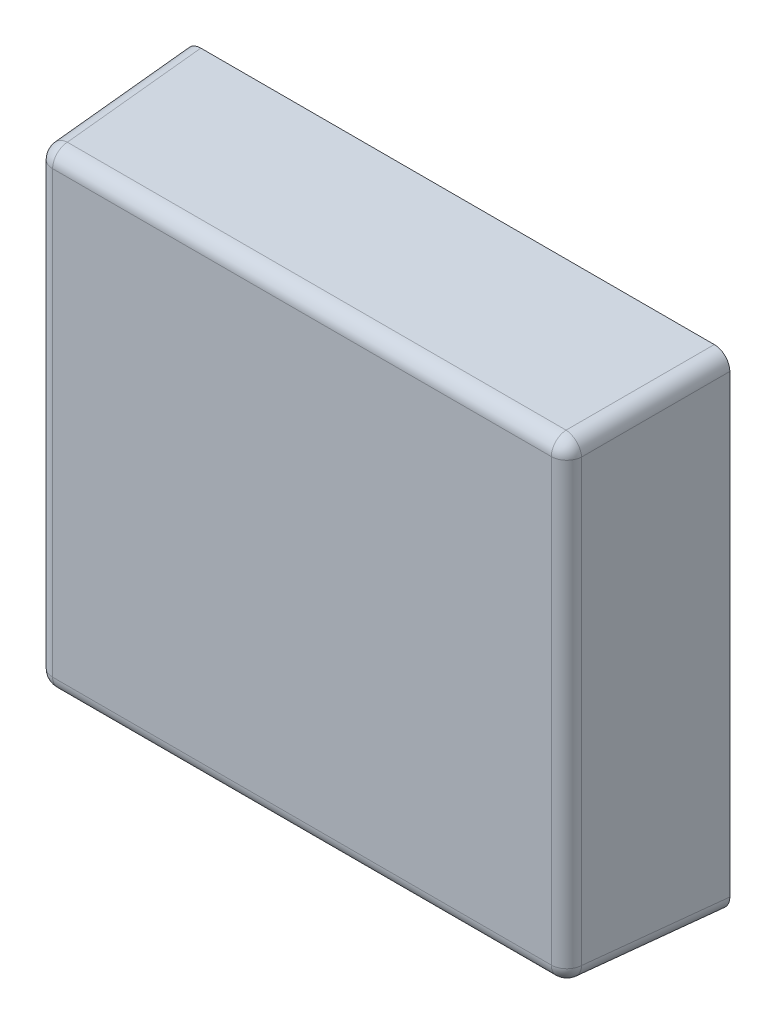
ISO-10303-21;
HEADER;
FILE_DESCRIPTION(('STEP AP214'),'2;1');
FILE_NAME('part.step','',(''),(''),'','','');
FILE_SCHEMA(('AUTOMOTIVE_DESIGN { 1 0 10303 214 1 1 1 1 }'));
ENDSEC;
DATA;
#1=APPLICATION_CONTEXT('core data for automotive mechanical design processes');
#2=APPLICATION_PROTOCOL_DEFINITION('international standard','automotive_design',2000,#1);
#3=PRODUCT_CONTEXT('',#1,'mechanical');
#4=PRODUCT('Part','Part','',(#3));
#5=PRODUCT_RELATED_PRODUCT_CATEGORY('part','',(#4));
#6=PRODUCT_DEFINITION_FORMATION('','',#4);
#7=PRODUCT_DEFINITION_CONTEXT('part definition',#1,'design');
#8=PRODUCT_DEFINITION('design','',#6,#7);
#9=PRODUCT_DEFINITION_SHAPE('','',#8);
#10=(LENGTH_UNIT() NAMED_UNIT(*) SI_UNIT(.MILLI.,.METRE.));
#11=(NAMED_UNIT(*) PLANE_ANGLE_UNIT() SI_UNIT($,.RADIAN.));
#12=(NAMED_UNIT(*) SI_UNIT($,.STERADIAN.) SOLID_ANGLE_UNIT());
#13=UNCERTAINTY_MEASURE_WITH_UNIT(LENGTH_MEASURE(1.E-05),#10,'distance_accuracy_value','');
#14=(GEOMETRIC_REPRESENTATION_CONTEXT(3) GLOBAL_UNCERTAINTY_ASSIGNED_CONTEXT((#13)) GLOBAL_UNIT_ASSIGNED_CONTEXT((#10,
#11,#12)) REPRESENTATION_CONTEXT('',''));
#15=CARTESIAN_POINT('',(0.,0.,0.));
#16=DIRECTION('',(0.,0.,1.));
#17=DIRECTION('',(1.,0.,0.));
#18=AXIS2_PLACEMENT_3D('',#15,#16,#17);
#19=CARTESIAN_POINT('',(-0.7,-0.625,0.4));
#20=DIRECTION('',(0.,0.,1.));
#21=DIRECTION('',(1.,0.,0.));
#22=AXIS2_PLACEMENT_3D('',#19,#20,#21);
#23=PLANE('',#22);
#24=DIRECTION('',(0.,1.,0.));
#25=VECTOR('',#24,1.);
#26=CARTESIAN_POINT('',(-0.641078305618185,-0.625,0.4));
#27=LINE('',#26,#25);
#28=CARTESIAN_POINT('',(-0.641078305618185,-0.566078305618188,0.4));
#29=VERTEX_POINT('',#28);
#30=CARTESIAN_POINT('',(-0.641078305618185,0.566078305618189,0.4));
#31=VERTEX_POINT('',#30);
#32=EDGE_CURVE('E98',#29,#31,#27,.T.);
#33=ORIENTED_EDGE('',*,*,#32,.F.);
#34=DIRECTION('',(-1.,0.,0.));
#35=VECTOR('',#34,1.);
#36=CARTESIAN_POINT('',(-0.7,-0.566078305618188,0.4));
#37=LINE('',#36,#35);
#38=CARTESIAN_POINT('',(0.641078305618192,-0.566078305618188,0.4));
#39=VERTEX_POINT('',#38);
#40=EDGE_CURVE('E100',#39,#29,#37,.T.);
#41=ORIENTED_EDGE('',*,*,#40,.F.);
#42=DIRECTION('',(0.,-1.,0.));
#43=VECTOR('',#42,1.);
#44=CARTESIAN_POINT('',(0.641078305618192,-0.625,0.4));
#45=LINE('',#44,#43);
#46=CARTESIAN_POINT('',(0.641078305618192,0.566078305618189,0.4));
#47=VERTEX_POINT('',#46);
#48=EDGE_CURVE('E92',#47,#39,#45,.T.);
#49=ORIENTED_EDGE('',*,*,#48,.F.);
#50=DIRECTION('',(1.,0.,0.));
#51=VECTOR('',#50,1.);
#52=CARTESIAN_POINT('',(-0.7,0.566078305618189,0.4));
#53=LINE('',#52,#51);
#54=EDGE_CURVE('E102',#31,#47,#53,.T.);
#55=ORIENTED_EDGE('',*,*,#54,.F.);
#56=EDGE_LOOP('',(#33,#41,#49,#55));
#57=FACE_BOUND('',#56,.T.);
#58=ADVANCED_FACE('F16',(#57),#23,.T.);
#59=CARTESIAN_POINT('',(-0.641078305618185,0.566078305618189,0.36));
#60=DIRECTION('',(1.,0.,0.));
#61=DIRECTION('',(0.,1.,0.));
#62=AXIS2_PLACEMENT_3D('',#59,#60,#61);
#63=SPHERICAL_SURFACE('',#62,0.04);
#64=CARTESIAN_POINT('',(-0.641078305618185,0.566078305618189,0.36));
#65=DIRECTION('',(0.,1.,0.));
#66=DIRECTION('',(0.,0.,1.));
#67=AXIS2_PLACEMENT_3D('',#64,#65,#66);
#68=CIRCLE('',#67,0.04);
#69=CARTESIAN_POINT('',(-0.68102348700837,0.566078305618191,0.362093438249718));
#70=VERTEX_POINT('',#69);
#71=EDGE_CURVE('E83',#31,#70,#68,.F.);
#72=ORIENTED_EDGE('',*,*,#71,.F.);
#73=CARTESIAN_POINT('',(-0.641078305618185,0.566078305618189,0.36));
#74=DIRECTION('',(1.,0.,0.));
#75=DIRECTION('',(0.,1.,0.));
#76=AXIS2_PLACEMENT_3D('',#73,#74,#75);
#77=CIRCLE('',#76,0.04);
#78=CARTESIAN_POINT('',(-0.641078305618185,0.606023487008372,0.362093438249718));
#79=VERTEX_POINT('',#78);
#80=EDGE_CURVE('E152',#79,#31,#77,.T.);
#81=ORIENTED_EDGE('',*,*,#80,.F.);
#82=CARTESIAN_POINT('',(-0.641078305618185,0.566078305618189,0.36));
#83=DIRECTION('',(0.0522644276887139,-0.0522644276887139,0.997264688634237));
#84=DIRECTION('',(0.998629534754574,0.,-0.0523359562429438));
#85=AXIS2_PLACEMENT_3D('',#82,#83,#84);
#86=CIRCLE('',#85,0.04);
#87=EDGE_CURVE('E19',#70,#79,#86,.F.);
#88=ORIENTED_EDGE('',*,*,#87,.F.);
#89=EDGE_LOOP('',(#72,#81,#88));
#90=FACE_BOUND('',#89,.T.);
#91=ADVANCED_FACE('F141',(#90),#63,.T.);
#92=CARTESIAN_POINT('',(-0.641078305618185,-0.625,0.36));
#93=DIRECTION('',(0.,1.,0.));
#94=DIRECTION('',(0.,0.,1.));
#95=AXIS2_PLACEMENT_3D('',#92,#93,#94);
#96=CYLINDRICAL_SURFACE('',#95,0.04);
#97=ORIENTED_EDGE('',*,*,#71,.T.);
#98=DIRECTION('',(0.,1.,0.));
#99=VECTOR('',#98,1.);
#100=CARTESIAN_POINT('',(-0.681023487008371,0.,0.362093438249718));
#101=LINE('',#100,#99);
#102=CARTESIAN_POINT('',(-0.68102348700837,-0.566078305618188,0.362093438249718));
#103=VERTEX_POINT('',#102);
#104=EDGE_CURVE('E107',#103,#70,#101,.T.);
#105=ORIENTED_EDGE('',*,*,#104,.F.);
#106=CARTESIAN_POINT('',(-0.641078305618185,-0.566078305618188,0.36));
#107=DIRECTION('',(0.,-1.,0.));
#108=DIRECTION('',(1.,0.,0.));
#109=AXIS2_PLACEMENT_3D('',#106,#107,#108);
#110=CIRCLE('',#109,0.04);
#111=EDGE_CURVE('E105',#29,#103,#110,.T.);
#112=ORIENTED_EDGE('',*,*,#111,.F.);
#113=ORIENTED_EDGE('',*,*,#32,.T.);
#114=EDGE_LOOP('',(#97,#105,#112,#113));
#115=FACE_BOUND('',#114,.T.);
#116=ADVANCED_FACE('F106',(#115),#96,.T.);
#117=CARTESIAN_POINT('',(-0.641078305618185,-0.566078305618188,0.36));
#118=DIRECTION('',(1.,0.,0.));
#119=DIRECTION('',(0.,1.,0.));
#120=AXIS2_PLACEMENT_3D('',#117,#118,#119);
#121=SPHERICAL_SURFACE('',#120,0.04);
#122=CARTESIAN_POINT('',(-0.641078305618185,-0.566078305618188,0.36));
#123=DIRECTION('',(0.0522644276887139,0.0522644276887139,0.997264688634237));
#124=DIRECTION('',(0.998629534754574,0.,-0.0523359562429438));
#125=AXIS2_PLACEMENT_3D('',#122,#123,#124);
#126=CIRCLE('',#125,0.04);
#127=CARTESIAN_POINT('',(-0.641078305618186,-0.606023487008371,0.362093438249718));
#128=VERTEX_POINT('',#127);
#129=EDGE_CURVE('E122',#128,#103,#126,.F.);
#130=ORIENTED_EDGE('',*,*,#129,.F.);
#131=CARTESIAN_POINT('',(-0.641078305618185,-0.566078305618188,0.36));
#132=DIRECTION('',(-1.,0.,0.));
#133=DIRECTION('',(0.,-1.,0.));
#134=AXIS2_PLACEMENT_3D('',#131,#132,#133);
#135=CIRCLE('',#134,0.04);
#136=EDGE_CURVE('E113',#29,#128,#135,.F.);
#137=ORIENTED_EDGE('',*,*,#136,.F.);
#138=ORIENTED_EDGE('',*,*,#111,.T.);
#139=EDGE_LOOP('',(#130,#137,#138));
#140=FACE_BOUND('',#139,.T.);
#141=ADVANCED_FACE('F121',(#140),#121,.T.);
#142=CARTESIAN_POINT('',(-0.7,-0.566078305618188,0.36));
#143=DIRECTION('',(-1.,0.,0.));
#144=DIRECTION('',(0.,-1.,0.));
#145=AXIS2_PLACEMENT_3D('',#142,#143,#144);
#146=CYLINDRICAL_SURFACE('',#145,0.04);
#147=CARTESIAN_POINT('',(0.641078305618192,-0.566078305618188,0.36));
#148=DIRECTION('',(1.,0.,0.));
#149=DIRECTION('',(0.,1.,0.));
#150=AXIS2_PLACEMENT_3D('',#147,#148,#149);
#151=CIRCLE('',#150,0.04);
#152=CARTESIAN_POINT('',(0.641078305618192,-0.606023487008371,0.362093438249718));
#153=VERTEX_POINT('',#152);
#154=EDGE_CURVE('E119',#39,#153,#151,.T.);
#155=ORIENTED_EDGE('',*,*,#154,.F.);
#156=ORIENTED_EDGE('',*,*,#40,.T.);
#157=ORIENTED_EDGE('',*,*,#136,.T.);
#158=DIRECTION('',(1.,0.,0.));
#159=VECTOR('',#158,1.);
#160=CARTESIAN_POINT('',(0.,-0.606023487008371,0.362093438249718));
#161=LINE('',#160,#159);
#162=EDGE_CURVE('E194',#153,#128,#161,.F.);
#163=ORIENTED_EDGE('',*,*,#162,.F.);
#164=EDGE_LOOP('',(#155,#156,#157,#163));
#165=FACE_BOUND('',#164,.T.);
#166=ADVANCED_FACE('F116',(#165),#146,.T.);
#167=CARTESIAN_POINT('',(0.641078305618192,-0.566078305618188,0.36));
#168=DIRECTION('',(1.,0.,0.));
#169=DIRECTION('',(0.,1.,0.));
#170=AXIS2_PLACEMENT_3D('',#167,#168,#169);
#171=SPHERICAL_SURFACE('',#170,0.04);
#172=CARTESIAN_POINT('',(0.641078305618191,-0.566078305618188,0.36));
#173=DIRECTION('',(-0.0522644276887139,0.0522644276887139,0.997264688634237));
#174=DIRECTION('',(0.998629534754574,0.,0.0523359562429438));
#175=AXIS2_PLACEMENT_3D('',#172,#173,#174);
#176=CIRCLE('',#175,0.04);
#177=CARTESIAN_POINT('',(0.681023487008373,-0.566078305618189,0.362093438249718));
#178=VERTEX_POINT('',#177);
#179=EDGE_CURVE('E188',#178,#153,#176,.F.);
#180=ORIENTED_EDGE('',*,*,#179,.F.);
#181=CARTESIAN_POINT('',(0.641078305618192,-0.566078305618188,0.36));
#182=DIRECTION('',(0.,-1.,0.));
#183=DIRECTION('',(1.,0.,0.));
#184=AXIS2_PLACEMENT_3D('',#181,#182,#183);
#185=CIRCLE('',#184,0.04);
#186=EDGE_CURVE('E157',#39,#178,#185,.F.);
#187=ORIENTED_EDGE('',*,*,#186,.F.);
#188=ORIENTED_EDGE('',*,*,#154,.T.);
#189=EDGE_LOOP('',(#180,#187,#188));
#190=FACE_BOUND('',#189,.T.);
#191=ADVANCED_FACE('F225',(#190),#171,.T.);
#192=CARTESIAN_POINT('',(0.641078305618192,-0.625,0.36));
#193=DIRECTION('',(0.,-1.,0.));
#194=DIRECTION('',(1.,0.,0.));
#195=AXIS2_PLACEMENT_3D('',#192,#193,#194);
#196=CYLINDRICAL_SURFACE('',#195,0.04);
#197=CARTESIAN_POINT('',(0.641078305618192,0.566078305618189,0.36));
#198=DIRECTION('',(0.,-1.,0.));
#199=DIRECTION('',(1.,0.,0.));
#200=AXIS2_PLACEMENT_3D('',#197,#198,#199);
#201=CIRCLE('',#200,0.04);
#202=CARTESIAN_POINT('',(0.681023487008373,0.566078305618189,0.362093438249718));
#203=VERTEX_POINT('',#202);
#204=EDGE_CURVE('E156',#47,#203,#201,.F.);
#205=ORIENTED_EDGE('',*,*,#204,.F.);
#206=ORIENTED_EDGE('',*,*,#48,.T.);
#207=ORIENTED_EDGE('',*,*,#186,.T.);
#208=DIRECTION('',(0.,1.,0.));
#209=VECTOR('',#208,1.);
#210=CARTESIAN_POINT('',(0.681023487008371,0.,0.362093438249718));
#211=LINE('',#210,#209);
#212=EDGE_CURVE('E187',#203,#178,#211,.F.);
#213=ORIENTED_EDGE('',*,*,#212,.F.);
#214=EDGE_LOOP('',(#205,#206,#207,#213));
#215=FACE_BOUND('',#214,.T.);
#216=ADVANCED_FACE('F221',(#215),#196,.T.);
#217=CARTESIAN_POINT('',(0.641078305618192,0.566078305618189,0.36));
#218=DIRECTION('',(1.,0.,0.));
#219=DIRECTION('',(0.,1.,0.));
#220=AXIS2_PLACEMENT_3D('',#217,#218,#219);
#221=SPHERICAL_SURFACE('',#220,0.04);
#222=ORIENTED_EDGE('',*,*,#204,.T.);
#223=CARTESIAN_POINT('',(0.641078305618192,0.566078305618189,0.36));
#224=DIRECTION('',(-0.0522644276887139,-0.0522644276887139,0.997264688634237));
#225=DIRECTION('',(0.998629534754574,0.,0.0523359562429438));
#226=AXIS2_PLACEMENT_3D('',#223,#224,#225);
#227=CIRCLE('',#226,0.04);
#228=CARTESIAN_POINT('',(0.641078305618193,0.606023487008371,0.362093438249718));
#229=VERTEX_POINT('',#228);
#230=EDGE_CURVE('E182',#229,#203,#227,.F.);
#231=ORIENTED_EDGE('',*,*,#230,.F.);
#232=CARTESIAN_POINT('',(0.641078305618192,0.566078305618189,0.36));
#233=DIRECTION('',(1.,0.,0.));
#234=DIRECTION('',(0.,1.,0.));
#235=AXIS2_PLACEMENT_3D('',#232,#233,#234);
#236=CIRCLE('',#235,0.04);
#237=EDGE_CURVE('E151',#47,#229,#236,.F.);
#238=ORIENTED_EDGE('',*,*,#237,.F.);
#239=EDGE_LOOP('',(#222,#231,#238));
#240=FACE_BOUND('',#239,.T.);
#241=ADVANCED_FACE('F216',(#240),#221,.T.);
#242=CARTESIAN_POINT('',(-0.7,0.566078305618189,0.36));
#243=DIRECTION('',(1.,0.,0.));
#244=DIRECTION('',(0.,1.,0.));
#245=AXIS2_PLACEMENT_3D('',#242,#243,#244);
#246=CYLINDRICAL_SURFACE('',#245,0.04);
#247=ORIENTED_EDGE('',*,*,#237,.T.);
#248=DIRECTION('',(1.,0.,0.));
#249=VECTOR('',#248,1.);
#250=CARTESIAN_POINT('',(0.,0.606023487008371,0.362093438249718));
#251=LINE('',#250,#249);
#252=EDGE_CURVE('E181',#79,#229,#251,.T.);
#253=ORIENTED_EDGE('',*,*,#252,.F.);
#254=ORIENTED_EDGE('',*,*,#80,.T.);
#255=ORIENTED_EDGE('',*,*,#54,.T.);
#256=EDGE_LOOP('',(#247,#253,#254,#255));
#257=FACE_BOUND('',#256,.T.);
#258=ADVANCED_FACE('F220',(#257),#246,.T.);
#259=CARTESIAN_POINT('',(-0.658456700183969,0.583456700183973,0.0284004778770056));
#260=DIRECTION('',(0.0522644276887139,-0.0522644276887139,0.997264688634237));
#261=DIRECTION('',(0.998629534754574,0.,-0.0523359562429438));
#262=AXIS2_PLACEMENT_3D('',#259,#260,#261);
#263=CYLINDRICAL_SURFACE('',#262,0.04);
#264=ORIENTED_EDGE('',*,*,#87,.T.);
#265=DIRECTION('',(0.0522644276887146,-0.052264427688714,0.997264688634237));
#266=VECTOR('',#265,1.);
#267=CARTESIAN_POINT('',(-0.660054818609814,0.625,0.));
#268=LINE('',#267,#266);
#269=CARTESIAN_POINT('',(-0.660054818609814,0.625,0.));
#270=VERTEX_POINT('',#269);
#271=EDGE_CURVE('E178',#270,#79,#268,.T.);
#272=ORIENTED_EDGE('',*,*,#271,.F.);
#273=CARTESIAN_POINT('',(-0.65994510616008,0.584945106160084,0.));
#274=DIRECTION('',(0.,0.,1.));
#275=DIRECTION('',(0.707106781186548,-0.707106781186548,0.));
#276=AXIS2_PLACEMENT_3D('',#273,#274,#275);
#277=ELLIPSE('',#276,0.0401097125526227,0.04);
#278=CARTESIAN_POINT('',(-0.699999999999998,0.585054818609817,0.));
#279=VERTEX_POINT('',#278);
#280=EDGE_CURVE('E175',#270,#279,#277,.T.);
#281=ORIENTED_EDGE('',*,*,#280,.T.);
#282=DIRECTION('',(-0.0522644276887139,0.0522644276887119,-0.997264688634238));
#283=VECTOR('',#282,1.);
#284=CARTESIAN_POINT('',(-0.681023487008371,0.566078305618189,0.362093438249718));
#285=LINE('',#284,#283);
#286=EDGE_CURVE('E132',#70,#279,#285,.T.);
#287=ORIENTED_EDGE('',*,*,#286,.F.);
#288=EDGE_LOOP('',(#264,#272,#281,#287));
#289=FACE_BOUND('',#288,.T.);
#290=ADVANCED_FACE('F276',(#289),#263,.T.);
#291=CARTESIAN_POINT('',(-0.7,0.,0.));
#292=DIRECTION('',(-0.998629534754574,0.,0.0523359562429438));
#293=DIRECTION('',(0.0523359562429438,0.,0.998629534754574));
#294=AXIS2_PLACEMENT_3D('',#291,#292,#293);
#295=PLANE('',#294);
#296=DIRECTION('',(0.,1.,0.));
#297=VECTOR('',#296,1.);
#298=CARTESIAN_POINT('',(-0.7,-0.625,0.));
#299=LINE('',#298,#297);
#300=CARTESIAN_POINT('',(-0.699999999999998,-0.585054818609817,0.));
#301=VERTEX_POINT('',#300);
#302=EDGE_CURVE('E174',#279,#301,#299,.F.);
#303=ORIENTED_EDGE('',*,*,#302,.T.);
#304=DIRECTION('',(0.0522644276887139,0.0522644276887139,0.997264688634237));
#305=VECTOR('',#304,1.);
#306=CARTESIAN_POINT('',(-0.69819701379403,-0.58325183240385,0.0344030262421455));
#307=LINE('',#306,#305);
#308=EDGE_CURVE('E192',#103,#301,#307,.F.);
#309=ORIENTED_EDGE('',*,*,#308,.F.);
#310=ORIENTED_EDGE('',*,*,#104,.T.);
#311=ORIENTED_EDGE('',*,*,#286,.T.);
#312=EDGE_LOOP('',(#303,#309,#310,#311));
#313=FACE_BOUND('',#312,.T.);
#314=ADVANCED_FACE('F280',(#313),#295,.T.);
#315=CARTESIAN_POINT('',(-0.658251832403847,-0.58325183240385,0.0323095879924278));
#316=DIRECTION('',(0.0522644276887139,0.0522644276887139,0.997264688634237));
#317=DIRECTION('',(0.998629534754574,0.,-0.0523359562429438));
#318=AXIS2_PLACEMENT_3D('',#315,#316,#317);
#319=CYLINDRICAL_SURFACE('',#318,0.04);
#320=CARTESIAN_POINT('',(-0.65994510616008,-0.584945106160083,0.));
#321=DIRECTION('',(0.,0.,1.));
#322=DIRECTION('',(0.707106781186548,0.707106781186548,0.));
#323=AXIS2_PLACEMENT_3D('',#320,#321,#322);
#324=ELLIPSE('',#323,0.0401097125526227,0.04);
#325=CARTESIAN_POINT('',(-0.660054818609814,-0.625,0.));
#326=VERTEX_POINT('',#325);
#327=EDGE_CURVE('E171',#301,#326,#324,.T.);
#328=ORIENTED_EDGE('',*,*,#327,.T.);
#329=DIRECTION('',(-0.0522644276887146,-0.052264427688714,-0.997264688634237));
#330=VECTOR('',#329,1.);
#331=CARTESIAN_POINT('',(-0.641078305618185,-0.606023487008371,0.362093438249718));
#332=LINE('',#331,#330);
#333=EDGE_CURVE('E191',#128,#326,#332,.T.);
#334=ORIENTED_EDGE('',*,*,#333,.F.);
#335=ORIENTED_EDGE('',*,*,#129,.T.);
#336=ORIENTED_EDGE('',*,*,#308,.T.);
#337=EDGE_LOOP('',(#328,#334,#335,#336));
#338=FACE_BOUND('',#337,.T.);
#339=ADVANCED_FACE('F286',(#338),#319,.T.);
#340=CARTESIAN_POINT('',(0.,-0.625,0.));
#341=DIRECTION('',(0.,-0.998629534754574,0.0523359562429438));
#342=DIRECTION('',(0.,-0.0523359562429438,-0.998629534754574));
#343=AXIS2_PLACEMENT_3D('',#340,#341,#342);
#344=PLANE('',#343);
#345=ORIENTED_EDGE('',*,*,#162,.T.);
#346=ORIENTED_EDGE('',*,*,#333,.T.);
#347=DIRECTION('',(1.,0.,0.));
#348=VECTOR('',#347,1.);
#349=CARTESIAN_POINT('',(-0.7,-0.625,0.));
#350=LINE('',#349,#348);
#351=CARTESIAN_POINT('',(0.66005481860982,-0.625,0.));
#352=VERTEX_POINT('',#351);
#353=EDGE_CURVE('E170',#326,#352,#350,.T.);
#354=ORIENTED_EDGE('',*,*,#353,.T.);
#355=DIRECTION('',(-0.0522644276887139,0.0522644276887139,0.997264688634237));
#356=VECTOR('',#355,1.);
#357=CARTESIAN_POINT('',(0.658456700183976,-0.623401881574155,0.0304939161267234));
#358=LINE('',#357,#356);
#359=EDGE_CURVE('E190',#153,#352,#358,.F.);
#360=ORIENTED_EDGE('',*,*,#359,.F.);
#361=EDGE_LOOP('',(#345,#346,#354,#360));
#362=FACE_BOUND('',#361,.T.);
#363=ADVANCED_FACE('F257',(#362),#344,.T.);
#364=CARTESIAN_POINT('',(0.658456700183975,-0.583456700183972,0.0284004778770056));
#365=DIRECTION('',(-0.0522644276887139,0.0522644276887139,0.997264688634237));
#366=DIRECTION('',(0.998629534754574,0.,0.0523359562429438));
#367=AXIS2_PLACEMENT_3D('',#364,#365,#366);
#368=CYLINDRICAL_SURFACE('',#367,0.04);
#369=ORIENTED_EDGE('',*,*,#179,.T.);
#370=ORIENTED_EDGE('',*,*,#359,.T.);
#371=CARTESIAN_POINT('',(0.659945106160086,-0.584945106160083,0.));
#372=DIRECTION('',(0.,0.,1.));
#373=DIRECTION('',(-0.707106781186548,0.707106781186548,0.));
#374=AXIS2_PLACEMENT_3D('',#371,#372,#373);
#375=ELLIPSE('',#374,0.0401097125526227,0.04);
#376=CARTESIAN_POINT('',(0.700000000000001,-0.585054818609817,0.));
#377=VERTEX_POINT('',#376);
#378=EDGE_CURVE('E167',#352,#377,#375,.T.);
#379=ORIENTED_EDGE('',*,*,#378,.T.);
#380=DIRECTION('',(-0.052264427688714,0.0522644276887146,0.997264688634237));
#381=VECTOR('',#380,1.);
#382=CARTESIAN_POINT('',(0.7,-0.585054818609817,0.));
#383=LINE('',#382,#381);
#384=EDGE_CURVE('E185',#178,#377,#383,.F.);
#385=ORIENTED_EDGE('',*,*,#384,.F.);
#386=EDGE_LOOP('',(#369,#370,#379,#385));
#387=FACE_BOUND('',#386,.T.);
#388=ADVANCED_FACE('F247',(#387),#368,.T.);
#389=CARTESIAN_POINT('',(0.7,0.,0.));
#390=DIRECTION('',(0.998629534754574,0.,0.0523359562429438));
#391=DIRECTION('',(0.0523359562429438,0.,-0.998629534754574));
#392=AXIS2_PLACEMENT_3D('',#389,#390,#391);
#393=PLANE('',#392);
#394=ORIENTED_EDGE('',*,*,#212,.T.);
#395=ORIENTED_EDGE('',*,*,#384,.T.);
#396=DIRECTION('',(0.,1.,0.));
#397=VECTOR('',#396,1.);
#398=CARTESIAN_POINT('',(0.7,-0.625,0.));
#399=LINE('',#398,#397);
#400=CARTESIAN_POINT('',(0.700000000000002,0.585054818609818,0.));
#401=VERTEX_POINT('',#400);
#402=EDGE_CURVE('E166',#377,#401,#399,.T.);
#403=ORIENTED_EDGE('',*,*,#402,.T.);
#404=DIRECTION('',(0.052264427688714,0.0522644276887137,-0.997264688634237));
#405=VECTOR('',#404,1.);
#406=CARTESIAN_POINT('',(0.681023487008371,0.566078305618189,0.362093438249718));
#407=LINE('',#406,#405);
#408=EDGE_CURVE('E179',#203,#401,#407,.T.);
#409=ORIENTED_EDGE('',*,*,#408,.F.);
#410=EDGE_LOOP('',(#394,#395,#403,#409));
#411=FACE_BOUND('',#410,.T.);
#412=ADVANCED_FACE('F242',(#411),#393,.T.);
#413=CARTESIAN_POINT('',(0.658251832403854,0.583251832403851,0.0323095879924281));
#414=DIRECTION('',(-0.0522644276887139,-0.0522644276887139,0.997264688634237));
#415=DIRECTION('',(0.998629534754574,0.,0.0523359562429438));
#416=AXIS2_PLACEMENT_3D('',#413,#414,#415);
#417=CYLINDRICAL_SURFACE('',#416,0.04);
#418=CARTESIAN_POINT('',(0.659945106160087,0.584945106160084,0.));
#419=DIRECTION('',(0.,0.,1.));
#420=DIRECTION('',(-0.707106781186548,-0.707106781186548,0.));
#421=AXIS2_PLACEMENT_3D('',#418,#419,#420);
#422=ELLIPSE('',#421,0.0401097125526227,0.04);
#423=CARTESIAN_POINT('',(0.660054818609821,0.625000000000001,0.));
#424=VERTEX_POINT('',#423);
#425=EDGE_CURVE('E25',#401,#424,#422,.T.);
#426=ORIENTED_EDGE('',*,*,#425,.T.);
#427=DIRECTION('',(0.0522644276887119,0.052264427688714,-0.997264688634238));
#428=VECTOR('',#427,1.);
#429=CARTESIAN_POINT('',(0.641078305618192,0.606023487008371,0.362093438249718));
#430=LINE('',#429,#428);
#431=EDGE_CURVE('E33',#229,#424,#430,.T.);
#432=ORIENTED_EDGE('',*,*,#431,.F.);
#433=ORIENTED_EDGE('',*,*,#230,.T.);
#434=ORIENTED_EDGE('',*,*,#408,.T.);
#435=EDGE_LOOP('',(#426,#432,#433,#434));
#436=FACE_BOUND('',#435,.T.);
#437=ADVANCED_FACE('F275',(#436),#417,.T.);
#438=CARTESIAN_POINT('',(0.,0.625,0.));
#439=DIRECTION('',(0.,0.998629534754574,0.0523359562429438));
#440=DIRECTION('',(0.,-0.0523359562429438,0.998629534754574));
#441=AXIS2_PLACEMENT_3D('',#438,#439,#440);
#442=PLANE('',#441);
#443=DIRECTION('',(1.,0.,0.));
#444=VECTOR('',#443,1.);
#445=CARTESIAN_POINT('',(-0.7,0.625,0.));
#446=LINE('',#445,#444);
#447=EDGE_CURVE('E11',#424,#270,#446,.F.);
#448=ORIENTED_EDGE('',*,*,#447,.T.);
#449=ORIENTED_EDGE('',*,*,#271,.T.);
#450=ORIENTED_EDGE('',*,*,#252,.T.);
#451=ORIENTED_EDGE('',*,*,#431,.T.);
#452=EDGE_LOOP('',(#448,#449,#450,#451));
#453=FACE_BOUND('',#452,.T.);
#454=ADVANCED_FACE('F267',(#453),#442,.T.);
#455=CARTESIAN_POINT('',(-0.7,-0.625,0.));
#456=DIRECTION('',(0.,0.,1.));
#457=DIRECTION('',(1.,0.,0.));
#458=AXIS2_PLACEMENT_3D('',#455,#456,#457);
#459=PLANE('',#458);
#460=ORIENTED_EDGE('',*,*,#425,.F.);
#461=ORIENTED_EDGE('',*,*,#402,.F.);
#462=ORIENTED_EDGE('',*,*,#378,.F.);
#463=ORIENTED_EDGE('',*,*,#353,.F.);
#464=ORIENTED_EDGE('',*,*,#327,.F.);
#465=ORIENTED_EDGE('',*,*,#302,.F.);
#466=ORIENTED_EDGE('',*,*,#280,.F.);
#467=ORIENTED_EDGE('',*,*,#447,.F.);
#468=EDGE_LOOP('',(#460,#461,#462,#463,#464,#465,#466,#467));
#469=FACE_BOUND('',#468,.T.);
#470=ADVANCED_FACE('F254',(#469),#459,.F.);
#471=CLOSED_SHELL('',(#58,#91,#116,#141,#166,#191,#216,#241,#258,#290,#314,#339,#363,#388,#412,
#437,#454,#470));
#472=MANIFOLD_SOLID_BREP('B1',#471);
#473=ADVANCED_BREP_SHAPE_REPRESENTATION('',(#18,#472),#14);
#474=SHAPE_DEFINITION_REPRESENTATION(#9,#473);
ENDSEC;
END-ISO-10303-21;
